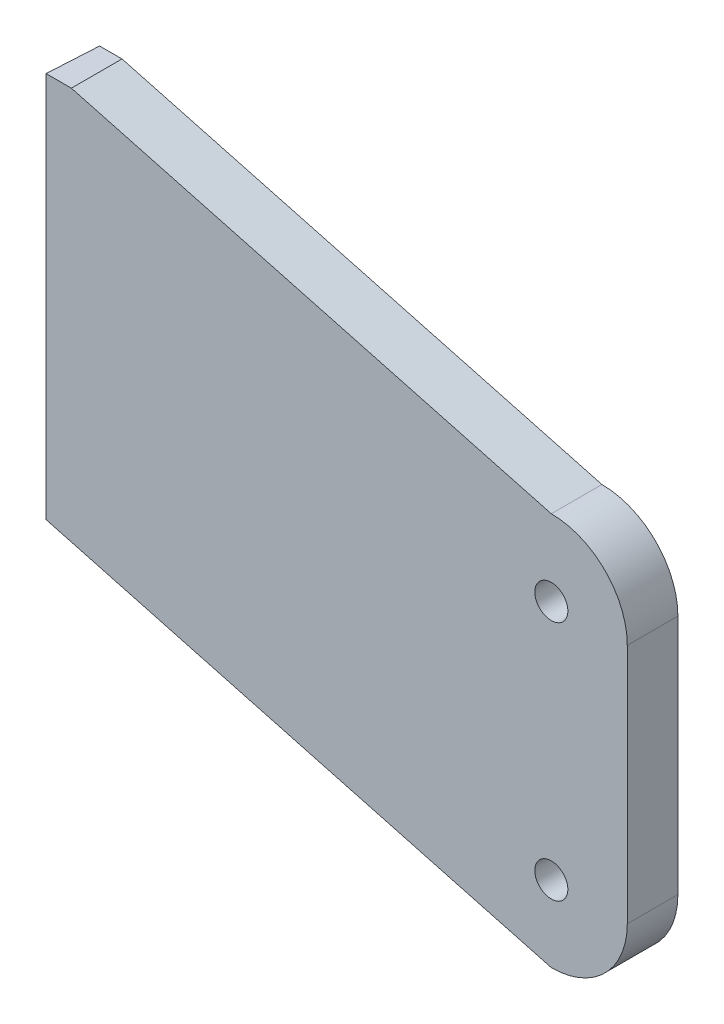
ISO-10303-21;
HEADER;
FILE_DESCRIPTION(('STEP AP214'),'2;1');
FILE_NAME('part.step','',(''),(''),'','','');
FILE_SCHEMA(('AUTOMOTIVE_DESIGN { 1 0 10303 214 1 1 1 1 }'));
ENDSEC;
DATA;
#1=APPLICATION_CONTEXT('core data for automotive mechanical design processes');
#2=APPLICATION_PROTOCOL_DEFINITION('international standard','automotive_design',2000,#1);
#3=PRODUCT_CONTEXT('',#1,'mechanical');
#4=PRODUCT('Part','Part','',(#3));
#5=PRODUCT_RELATED_PRODUCT_CATEGORY('part','',(#4));
#6=PRODUCT_DEFINITION_FORMATION('','',#4);
#7=PRODUCT_DEFINITION_CONTEXT('part definition',#1,'design');
#8=PRODUCT_DEFINITION('design','',#6,#7);
#9=PRODUCT_DEFINITION_SHAPE('','',#8);
#10=(LENGTH_UNIT() NAMED_UNIT(*) SI_UNIT(.MILLI.,.METRE.));
#11=(NAMED_UNIT(*) PLANE_ANGLE_UNIT() SI_UNIT($,.RADIAN.));
#12=(NAMED_UNIT(*) SI_UNIT($,.STERADIAN.) SOLID_ANGLE_UNIT());
#13=UNCERTAINTY_MEASURE_WITH_UNIT(LENGTH_MEASURE(1.E-05),#10,'distance_accuracy_value','');
#14=(GEOMETRIC_REPRESENTATION_CONTEXT(3) GLOBAL_UNCERTAINTY_ASSIGNED_CONTEXT((#13)) GLOBAL_UNIT_ASSIGNED_CONTEXT((#10,
#11,#12)) REPRESENTATION_CONTEXT('',''));
#15=CARTESIAN_POINT('',(0.,0.,0.));
#16=DIRECTION('',(0.,0.,1.));
#17=DIRECTION('',(1.,0.,0.));
#18=AXIS2_PLACEMENT_3D('',#15,#16,#17);
#19=CARTESIAN_POINT('',(0.,0.,0.));
#20=DIRECTION('',(0.,0.,1.));
#21=DIRECTION('',(1.,0.,0.));
#22=AXIS2_PLACEMENT_3D('',#19,#20,#21);
#23=PLANE('',#22);
#24=CARTESIAN_POINT('',(-15.,-23.8125,0.));
#25=DIRECTION('',(0.,0.,1.));
#26=DIRECTION('',(1.,0.,0.));
#27=AXIS2_PLACEMENT_3D('',#24,#25,#26);
#28=CIRCLE('',#27,3.2639);
#29=CARTESIAN_POINT('',(-11.7361,-23.8125,0.));
#30=VERTEX_POINT('',#29);
#31=EDGE_CURVE('E173',#30,#30,#28,.F.);
#32=ORIENTED_EDGE('',*,*,#31,.F.);
#33=EDGE_LOOP('',(#32));
#34=FACE_BOUND('',#33,.T.);
#35=CARTESIAN_POINT('',(-15.,23.8125,0.));
#36=DIRECTION('',(0.,0.,1.));
#37=DIRECTION('',(1.,0.,0.));
#38=AXIS2_PLACEMENT_3D('',#35,#36,#37);
#39=CIRCLE('',#38,3.2639);
#40=CARTESIAN_POINT('',(-11.7361,23.8125,0.));
#41=VERTEX_POINT('',#40);
#42=EDGE_CURVE('E169',#41,#41,#39,.T.);
#43=ORIENTED_EDGE('',*,*,#42,.T.);
#44=EDGE_LOOP('',(#43));
#45=FACE_BOUND('',#44,.T.);
#46=DIRECTION('',(0.,1.,0.));
#47=VECTOR('',#46,1.);
#48=CARTESIAN_POINT('',(-114.198978093451,-53.2440936926434,0.));
#49=LINE('',#48,#47);
#50=CARTESIAN_POINT('',(-114.198978093451,-12.2322139298705,0.));
#51=VERTEX_POINT('',#50);
#52=CARTESIAN_POINT('',(-114.198978093451,64.2083159442407,0.));
#53=VERTEX_POINT('',#52);
#54=EDGE_CURVE('E159',#51,#53,#49,.T.);
#55=ORIENTED_EDGE('',*,*,#54,.T.);
#56=DIRECTION('',(-1.,0.,0.));
#57=VECTOR('',#56,1.);
#58=CARTESIAN_POINT('',(0.,64.2083159442407,0.));
#59=LINE('',#58,#57);
#60=CARTESIAN_POINT('',(-109.778475403574,64.2083159442407,0.));
#61=VERTEX_POINT('',#60);
#62=EDGE_CURVE('E214',#61,#53,#59,.T.);
#63=ORIENTED_EDGE('',*,*,#62,.F.);
#64=DIRECTION('',(-0.965925826289068,0.258819045102521,0.));
#65=VECTOR('',#64,1.);
#66=CARTESIAN_POINT('',(8.6983155283833,32.4625554921917,0.));
#67=LINE('',#66,#65);
#68=CARTESIAN_POINT('',(-15.,38.8125,0.));
#69=VERTEX_POINT('',#68);
#70=EDGE_CURVE('E170',#69,#61,#67,.T.);
#71=ORIENTED_EDGE('',*,*,#70,.F.);
#72=CARTESIAN_POINT('',(-15.,23.8125,0.));
#73=DIRECTION('',(0.,0.,1.));
#74=DIRECTION('',(1.,0.,0.));
#75=AXIS2_PLACEMENT_3D('',#72,#73,#74);
#76=CIRCLE('',#75,15.);
#77=CARTESIAN_POINT('',(0.,23.8125,0.));
#78=VERTEX_POINT('',#77);
#79=EDGE_CURVE('E120',#78,#69,#76,.T.);
#80=ORIENTED_EDGE('',*,*,#79,.F.);
#81=DIRECTION('',(0.,1.,0.));
#82=VECTOR('',#81,1.);
#83=CARTESIAN_POINT('',(0.,0.,0.));
#84=LINE('',#83,#82);
#85=CARTESIAN_POINT('',(0.,-23.8125,0.));
#86=VERTEX_POINT('',#85);
#87=EDGE_CURVE('E191',#86,#78,#84,.T.);
#88=ORIENTED_EDGE('',*,*,#87,.F.);
#89=CARTESIAN_POINT('',(-15.,-23.8125,0.));
#90=DIRECTION('',(0.,0.,1.));
#91=DIRECTION('',(1.,0.,0.));
#92=AXIS2_PLACEMENT_3D('',#89,#90,#91);
#93=CIRCLE('',#92,15.);
#94=CARTESIAN_POINT('',(-15.,-38.8125,0.));
#95=VERTEX_POINT('',#94);
#96=EDGE_CURVE('E168',#86,#95,#93,.F.);
#97=ORIENTED_EDGE('',*,*,#96,.T.);
#98=DIRECTION('',(-0.965925826289068,0.258819045102521,0.));
#99=VECTOR('',#98,1.);
#100=CARTESIAN_POINT('',(-10.7079344716167,-39.9625554921918,0.));
#101=LINE('',#100,#99);
#102=EDGE_CURVE('E151',#95,#51,#101,.T.);
#103=ORIENTED_EDGE('',*,*,#102,.T.);
#104=EDGE_LOOP('',(#55,#63,#71,#80,#88,#97,#103));
#105=FACE_BOUND('',#104,.T.);
#106=ADVANCED_FACE('F85',(#34,#45,#105),#23,.F.);
#107=CARTESIAN_POINT('',(0.,0.,10.));
#108=DIRECTION('',(0.,0.,1.));
#109=DIRECTION('',(1.,0.,0.));
#110=AXIS2_PLACEMENT_3D('',#107,#108,#109);
#111=PLANE('',#110);
#112=DIRECTION('',(0.,1.,0.));
#113=VECTOR('',#112,1.);
#114=CARTESIAN_POINT('',(-114.770321228191,0.,10.));
#115=LINE('',#114,#113);
#116=CARTESIAN_POINT('',(-114.770321228191,-12.0791229983124,10.));
#117=VERTEX_POINT('',#116);
#118=CARTESIAN_POINT('',(-114.770321228191,64.2083159442407,9.99999999999999));
#119=VERTEX_POINT('',#118);
#120=EDGE_CURVE('E156',#117,#119,#115,.T.);
#121=ORIENTED_EDGE('',*,*,#120,.F.);
#122=DIRECTION('',(-0.965925826289068,0.258819045102521,0.));
#123=VECTOR('',#122,1.);
#124=CARTESIAN_POINT('',(-10.7079344716167,-39.9625554921918,10.));
#125=LINE('',#124,#123);
#126=CARTESIAN_POINT('',(-15.,-38.8125,10.));
#127=VERTEX_POINT('',#126);
#128=EDGE_CURVE('E153',#127,#117,#125,.T.);
#129=ORIENTED_EDGE('',*,*,#128,.F.);
#130=CARTESIAN_POINT('',(-15.,-23.8125,10.));
#131=DIRECTION('',(0.,0.,1.));
#132=DIRECTION('',(1.,0.,0.));
#133=AXIS2_PLACEMENT_3D('',#130,#131,#132);
#134=CIRCLE('',#133,15.);
#135=CARTESIAN_POINT('',(0.,-23.8125,10.));
#136=VERTEX_POINT('',#135);
#137=EDGE_CURVE('E181',#136,#127,#134,.F.);
#138=ORIENTED_EDGE('',*,*,#137,.F.);
#139=DIRECTION('',(0.,1.,0.));
#140=VECTOR('',#139,1.);
#141=CARTESIAN_POINT('',(0.,0.,10.));
#142=LINE('',#141,#140);
#143=CARTESIAN_POINT('',(0.,23.8125,10.));
#144=VERTEX_POINT('',#143);
#145=EDGE_CURVE('E206',#136,#144,#142,.T.);
#146=ORIENTED_EDGE('',*,*,#145,.T.);
#147=CARTESIAN_POINT('',(-15.,23.8125,10.));
#148=DIRECTION('',(0.,0.,1.));
#149=DIRECTION('',(1.,0.,0.));
#150=AXIS2_PLACEMENT_3D('',#147,#148,#149);
#151=CIRCLE('',#150,15.);
#152=CARTESIAN_POINT('',(-15.,38.8125,10.));
#153=VERTEX_POINT('',#152);
#154=EDGE_CURVE('E188',#144,#153,#151,.T.);
#155=ORIENTED_EDGE('',*,*,#154,.T.);
#156=DIRECTION('',(-0.965925826289068,0.258819045102521,0.));
#157=VECTOR('',#156,1.);
#158=CARTESIAN_POINT('',(8.6983155283833,32.4625554921917,10.));
#159=LINE('',#158,#157);
#160=CARTESIAN_POINT('',(-109.778475403574,64.2083159442407,10.));
#161=VERTEX_POINT('',#160);
#162=EDGE_CURVE('E202',#153,#161,#159,.T.);
#163=ORIENTED_EDGE('',*,*,#162,.T.);
#164=DIRECTION('',(-1.,0.,0.));
#165=VECTOR('',#164,1.);
#166=CARTESIAN_POINT('',(0.,64.2083159442407,10.));
#167=LINE('',#166,#165);
#168=EDGE_CURVE('E211',#161,#119,#167,.T.);
#169=ORIENTED_EDGE('',*,*,#168,.T.);
#170=EDGE_LOOP('',(#121,#129,#138,#146,#155,#163,#169));
#171=FACE_BOUND('',#170,.T.);
#172=CARTESIAN_POINT('',(-15.,23.8125,10.));
#173=DIRECTION('',(0.,0.,1.));
#174=DIRECTION('',(1.,0.,0.));
#175=AXIS2_PLACEMENT_3D('',#172,#173,#174);
#176=CIRCLE('',#175,3.2639);
#177=CARTESIAN_POINT('',(-11.7361,23.8125,10.));
#178=VERTEX_POINT('',#177);
#179=EDGE_CURVE('E198',#178,#178,#176,.T.);
#180=ORIENTED_EDGE('',*,*,#179,.F.);
#181=EDGE_LOOP('',(#180));
#182=FACE_BOUND('',#181,.T.);
#183=CARTESIAN_POINT('',(-15.,-23.8125,10.));
#184=DIRECTION('',(0.,0.,1.));
#185=DIRECTION('',(1.,0.,0.));
#186=AXIS2_PLACEMENT_3D('',#183,#184,#185);
#187=CIRCLE('',#186,3.2639);
#188=CARTESIAN_POINT('',(-11.7361,-23.8125,10.));
#189=VERTEX_POINT('',#188);
#190=EDGE_CURVE('E184',#189,#189,#187,.F.);
#191=ORIENTED_EDGE('',*,*,#190,.T.);
#192=EDGE_LOOP('',(#191));
#193=FACE_BOUND('',#192,.T.);
#194=ADVANCED_FACE('F220',(#171,#182,#193),#111,.T.);
#195=CARTESIAN_POINT('',(-15.,-23.8125,10.));
#196=DIRECTION('',(0.,0.,-1.));
#197=DIRECTION('',(-1.,0.,0.));
#198=AXIS2_PLACEMENT_3D('',#195,#196,#197);
#199=CYLINDRICAL_SURFACE('',#198,15.);
#200=ORIENTED_EDGE('',*,*,#96,.F.);
#201=DIRECTION('',(0.,0.,-1.));
#202=VECTOR('',#201,1.);
#203=CARTESIAN_POINT('',(0.,-23.8125,10.));
#204=LINE('',#203,#202);
#205=EDGE_CURVE('E12',#136,#86,#204,.T.);
#206=ORIENTED_EDGE('',*,*,#205,.F.);
#207=ORIENTED_EDGE('',*,*,#137,.T.);
#208=DIRECTION('',(0.,0.,-1.));
#209=VECTOR('',#208,1.);
#210=CARTESIAN_POINT('',(-15.,-38.8125,10.));
#211=LINE('',#210,#209);
#212=EDGE_CURVE('E102',#127,#95,#211,.T.);
#213=ORIENTED_EDGE('',*,*,#212,.T.);
#214=EDGE_LOOP('',(#200,#206,#207,#213));
#215=FACE_BOUND('',#214,.T.);
#216=ADVANCED_FACE('F87',(#215),#199,.T.);
#217=CARTESIAN_POINT('',(0.,0.,10.));
#218=DIRECTION('',(-1.,0.,0.));
#219=DIRECTION('',(0.,0.,1.));
#220=AXIS2_PLACEMENT_3D('',#217,#218,#219);
#221=PLANE('',#220);
#222=ORIENTED_EDGE('',*,*,#87,.T.);
#223=DIRECTION('',(0.,0.,-1.));
#224=VECTOR('',#223,1.);
#225=CARTESIAN_POINT('',(0.,23.8125,10.));
#226=LINE('',#225,#224);
#227=EDGE_CURVE('E94',#144,#78,#226,.T.);
#228=ORIENTED_EDGE('',*,*,#227,.F.);
#229=ORIENTED_EDGE('',*,*,#145,.F.);
#230=ORIENTED_EDGE('',*,*,#205,.T.);
#231=EDGE_LOOP('',(#222,#228,#229,#230));
#232=FACE_BOUND('',#231,.T.);
#233=ADVANCED_FACE('F234',(#232),#221,.F.);
#234=CARTESIAN_POINT('',(-15.,23.8125,10.));
#235=DIRECTION('',(0.,0.,-1.));
#236=DIRECTION('',(-1.,0.,0.));
#237=AXIS2_PLACEMENT_3D('',#234,#235,#236);
#238=CYLINDRICAL_SURFACE('',#237,15.);
#239=ORIENTED_EDGE('',*,*,#79,.T.);
#240=DIRECTION('',(0.,0.,-1.));
#241=VECTOR('',#240,1.);
#242=CARTESIAN_POINT('',(-15.,38.8125,10.));
#243=LINE('',#242,#241);
#244=EDGE_CURVE('E183',#153,#69,#243,.T.);
#245=ORIENTED_EDGE('',*,*,#244,.F.);
#246=ORIENTED_EDGE('',*,*,#154,.F.);
#247=ORIENTED_EDGE('',*,*,#227,.T.);
#248=EDGE_LOOP('',(#239,#245,#246,#247));
#249=FACE_BOUND('',#248,.T.);
#250=ADVANCED_FACE('F187',(#249),#238,.T.);
#251=CARTESIAN_POINT('',(8.6983155283833,32.4625554921917,10.));
#252=DIRECTION('',(-0.258819045102521,-0.965925826289068,0.));
#253=DIRECTION('',(0.965925826289068,-0.258819045102521,0.));
#254=AXIS2_PLACEMENT_3D('',#251,#252,#253);
#255=PLANE('',#254);
#256=ORIENTED_EDGE('',*,*,#70,.T.);
#257=DIRECTION('',(0.,0.,1.));
#258=VECTOR('',#257,1.);
#259=CARTESIAN_POINT('',(-109.778475403574,64.2083159442407,-40.));
#260=LINE('',#259,#258);
#261=EDGE_CURVE('E195',#61,#161,#260,.T.);
#262=ORIENTED_EDGE('',*,*,#261,.T.);
#263=ORIENTED_EDGE('',*,*,#162,.F.);
#264=ORIENTED_EDGE('',*,*,#244,.T.);
#265=EDGE_LOOP('',(#256,#262,#263,#264));
#266=FACE_BOUND('',#265,.T.);
#267=ADVANCED_FACE('F224',(#266),#255,.F.);
#268=CARTESIAN_POINT('',(-15.,23.8125,10.));
#269=DIRECTION('',(0.,0.,-1.));
#270=DIRECTION('',(-1.,0.,0.));
#271=AXIS2_PLACEMENT_3D('',#268,#269,#270);
#272=CYLINDRICAL_SURFACE('',#271,3.2639);
#273=ORIENTED_EDGE('',*,*,#179,.T.);
#274=EDGE_LOOP('',(#273));
#275=FACE_BOUND('',#274,.T.);
#276=ORIENTED_EDGE('',*,*,#42,.F.);
#277=EDGE_LOOP('',(#276));
#278=FACE_BOUND('',#277,.T.);
#279=ADVANCED_FACE('F226',(#275,#278),#272,.F.);
#280=CARTESIAN_POINT('',(-10.7079344716167,-39.9625554921918,10.));
#281=DIRECTION('',(-0.258819045102521,-0.965925826289068,0.));
#282=DIRECTION('',(0.965925826289068,-0.258819045102521,0.));
#283=AXIS2_PLACEMENT_3D('',#280,#281,#282);
#284=PLANE('',#283);
#285=DIRECTION('',(-0.0570346271199998,0.0152823822774142,0.998255227935827));
#286=VECTOR('',#285,1.);
#287=CARTESIAN_POINT('',(-114.407507727297,-12.1763385828802,3.64981429138124));
#288=LINE('',#287,#286);
#289=EDGE_CURVE('E147',#51,#117,#288,.T.);
#290=ORIENTED_EDGE('',*,*,#289,.F.);
#291=ORIENTED_EDGE('',*,*,#102,.F.);
#292=ORIENTED_EDGE('',*,*,#212,.F.);
#293=ORIENTED_EDGE('',*,*,#128,.T.);
#294=EDGE_LOOP('',(#290,#291,#292,#293));
#295=FACE_BOUND('',#294,.T.);
#296=ADVANCED_FACE('F149',(#295),#284,.T.);
#297=CARTESIAN_POINT('',(-15.,-23.8125,10.));
#298=DIRECTION('',(0.,0.,-1.));
#299=DIRECTION('',(-1.,0.,0.));
#300=AXIS2_PLACEMENT_3D('',#297,#298,#299);
#301=CYLINDRICAL_SURFACE('',#300,3.2639);
#302=ORIENTED_EDGE('',*,*,#190,.F.);
#303=EDGE_LOOP('',(#302));
#304=FACE_BOUND('',#303,.T.);
#305=ORIENTED_EDGE('',*,*,#31,.T.);
#306=EDGE_LOOP('',(#305));
#307=FACE_BOUND('',#306,.T.);
#308=ADVANCED_FACE('F248',(#304,#307),#301,.F.);
#309=CARTESIAN_POINT('',(2.27793660268188,64.2083159442407,-39.8698516560684));
#310=DIRECTION('',(0.,1.,0.));
#311=DIRECTION('',(0.,0.,1.));
#312=AXIS2_PLACEMENT_3D('',#309,#310,#311);
#313=PLANE('',#312);
#314=ORIENTED_EDGE('',*,*,#261,.F.);
#315=ORIENTED_EDGE('',*,*,#62,.T.);
#316=DIRECTION('',(-0.0570412885398924,0.,0.99837182021615));
#317=VECTOR('',#316,1.);
#318=CARTESIAN_POINT('',(-111.54947129383,64.2083159442407,-46.3733024607668));
#319=LINE('',#318,#317);
#320=EDGE_CURVE('E162',#53,#119,#319,.T.);
#321=ORIENTED_EDGE('',*,*,#320,.T.);
#322=ORIENTED_EDGE('',*,*,#168,.F.);
#323=EDGE_LOOP('',(#314,#315,#321,#322));
#324=FACE_BOUND('',#323,.T.);
#325=ADVANCED_FACE('F219',(#324),#313,.T.);
#326=CARTESIAN_POINT('',(-109.066028327415,-10.6773328411647,-89.8400532696823));
#327=DIRECTION('',(0.99837182021615,0.,0.0570412885398925));
#328=DIRECTION('',(0.0570412885398925,0.,-0.99837182021615));
#329=AXIS2_PLACEMENT_3D('',#326,#327,#328);
#330=PLANE('',#329);
#331=ORIENTED_EDGE('',*,*,#54,.F.);
#332=ORIENTED_EDGE('',*,*,#289,.T.);
#333=ORIENTED_EDGE('',*,*,#120,.T.);
#334=ORIENTED_EDGE('',*,*,#320,.F.);
#335=EDGE_LOOP('',(#331,#332,#333,#334));
#336=FACE_BOUND('',#335,.T.);
#337=ADVANCED_FACE('F160',(#336),#330,.F.);
#338=CLOSED_SHELL('',(#106,#194,#216,#233,#250,#267,#279,#296,#308,#325,#337));
#339=MANIFOLD_SOLID_BREP('B2',#338);
#340=ADVANCED_BREP_SHAPE_REPRESENTATION('',(#18,#339),#14);
#341=SHAPE_DEFINITION_REPRESENTATION(#9,#340);
ENDSEC;
END-ISO-10303-21;
